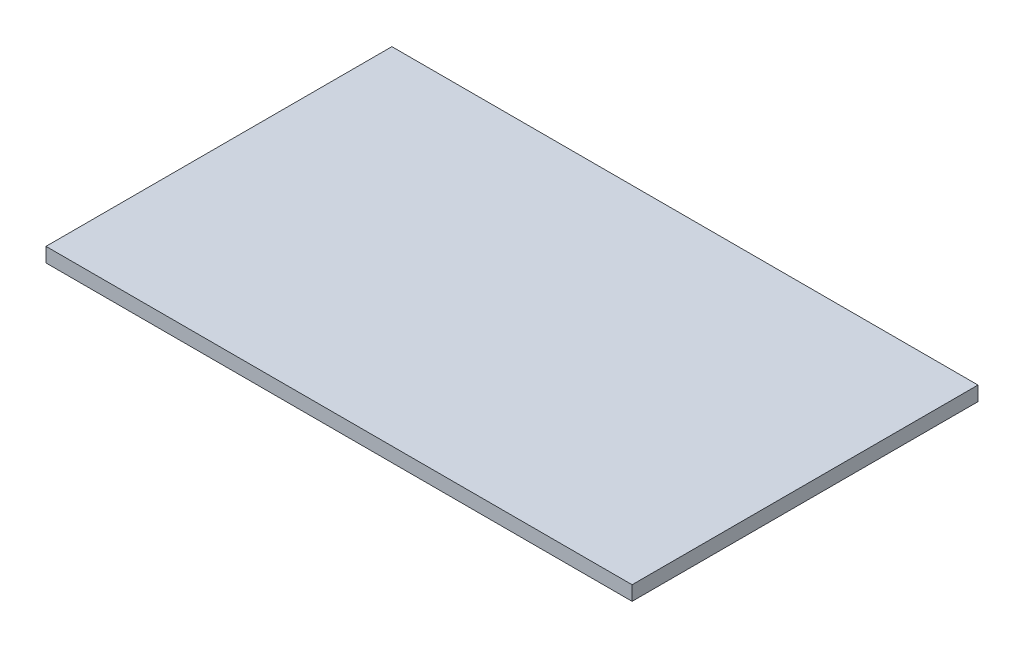
ISO-10303-21;
HEADER;
FILE_DESCRIPTION(('STEP AP214'),'2;1');
FILE_NAME('part.step','',(''),(''),'','','');
FILE_SCHEMA(('AUTOMOTIVE_DESIGN { 1 0 10303 214 1 1 1 1 }'));
ENDSEC;
DATA;
#1=APPLICATION_CONTEXT('core data for automotive mechanical design processes');
#2=APPLICATION_PROTOCOL_DEFINITION('international standard','automotive_design',2000,#1);
#3=PRODUCT_CONTEXT('',#1,'mechanical');
#4=PRODUCT('Part','Part','',(#3));
#5=PRODUCT_RELATED_PRODUCT_CATEGORY('part','',(#4));
#6=PRODUCT_DEFINITION_FORMATION('','',#4);
#7=PRODUCT_DEFINITION_CONTEXT('part definition',#1,'design');
#8=PRODUCT_DEFINITION('design','',#6,#7);
#9=PRODUCT_DEFINITION_SHAPE('','',#8);
#10=(LENGTH_UNIT() NAMED_UNIT(*) SI_UNIT(.MILLI.,.METRE.));
#11=(NAMED_UNIT(*) PLANE_ANGLE_UNIT() SI_UNIT($,.RADIAN.));
#12=(NAMED_UNIT(*) SI_UNIT($,.STERADIAN.) SOLID_ANGLE_UNIT());
#13=UNCERTAINTY_MEASURE_WITH_UNIT(LENGTH_MEASURE(1.E-05),#10,'distance_accuracy_value','');
#14=(GEOMETRIC_REPRESENTATION_CONTEXT(3) GLOBAL_UNCERTAINTY_ASSIGNED_CONTEXT((#13)) GLOBAL_UNIT_ASSIGNED_CONTEXT((#10,
#11,#12)) REPRESENTATION_CONTEXT('',''));
#15=CARTESIAN_POINT('',(0.,0.,0.));
#16=DIRECTION('',(0.,0.,1.));
#17=DIRECTION('',(1.,0.,0.));
#18=AXIS2_PLACEMENT_3D('',#15,#16,#17);
#19=CARTESIAN_POINT('',(-46.2660746500902,15.,-27.642019176537));
#20=DIRECTION('',(1.,0.,0.));
#21=DIRECTION('',(0.,0.,-1.));
#22=AXIS2_PLACEMENT_3D('',#19,#20,#21);
#23=PLANE('',#22);
#24=DIRECTION('',(0.,0.,1.));
#25=VECTOR('',#24,1.);
#26=CARTESIAN_POINT('',(-46.2660746500902,0.,-27.642019176537));
#27=LINE('',#26,#25);
#28=CARTESIAN_POINT('',(-46.2660746500902,0.,-27.642019176537));
#29=VERTEX_POINT('',#28);
#30=CARTESIAN_POINT('',(-46.2660746500902,0.,332.357980823463));
#31=VERTEX_POINT('',#30);
#32=EDGE_CURVE('E96',#29,#31,#27,.T.);
#33=ORIENTED_EDGE('',*,*,#32,.T.);
#34=DIRECTION('',(0.,-1.,0.));
#35=VECTOR('',#34,1.);
#36=CARTESIAN_POINT('',(-46.2660746500902,15.,332.357980823463));
#37=LINE('',#36,#35);
#38=CARTESIAN_POINT('',(-46.2660746500902,15.,332.357980823463));
#39=VERTEX_POINT('',#38);
#40=EDGE_CURVE('E11',#39,#31,#37,.T.);
#41=ORIENTED_EDGE('',*,*,#40,.F.);
#42=DIRECTION('',(0.,0.,1.));
#43=VECTOR('',#42,1.);
#44=CARTESIAN_POINT('',(-46.2660746500902,15.,-27.642019176537));
#45=LINE('',#44,#43);
#46=CARTESIAN_POINT('',(-46.2660746500902,15.,-27.642019176537));
#47=VERTEX_POINT('',#46);
#48=EDGE_CURVE('E84',#47,#39,#45,.T.);
#49=ORIENTED_EDGE('',*,*,#48,.F.);
#50=DIRECTION('',(0.,-1.,0.));
#51=VECTOR('',#50,1.);
#52=CARTESIAN_POINT('',(-46.2660746500902,15.,-27.642019176537));
#53=LINE('',#52,#51);
#54=EDGE_CURVE('E92',#47,#29,#53,.T.);
#55=ORIENTED_EDGE('',*,*,#54,.T.);
#56=EDGE_LOOP('',(#33,#41,#49,#55));
#57=FACE_BOUND('',#56,.T.);
#58=ADVANCED_FACE('F33',(#57),#23,.F.);
#59=CARTESIAN_POINT('',(-46.2660746500902,15.,332.357980823463));
#60=DIRECTION('',(0.,0.,-1.));
#61=DIRECTION('',(-1.,0.,0.));
#62=AXIS2_PLACEMENT_3D('',#59,#60,#61);
#63=PLANE('',#62);
#64=DIRECTION('',(1.,0.,0.));
#65=VECTOR('',#64,1.);
#66=CARTESIAN_POINT('',(-46.2660746500902,0.,332.357980823463));
#67=LINE('',#66,#65);
#68=CARTESIAN_POINT('',(563.73392534991,0.,332.357980823463));
#69=VERTEX_POINT('',#68);
#70=EDGE_CURVE('E88',#31,#69,#67,.T.);
#71=ORIENTED_EDGE('',*,*,#70,.T.);
#72=DIRECTION('',(0.,-1.,0.));
#73=VECTOR('',#72,1.);
#74=CARTESIAN_POINT('',(563.73392534991,15.,332.357980823463));
#75=LINE('',#74,#73);
#76=CARTESIAN_POINT('',(563.73392534991,15.,332.357980823463));
#77=VERTEX_POINT('',#76);
#78=EDGE_CURVE('E41',#77,#69,#75,.T.);
#79=ORIENTED_EDGE('',*,*,#78,.F.);
#80=DIRECTION('',(1.,0.,0.));
#81=VECTOR('',#80,1.);
#82=CARTESIAN_POINT('',(-46.2660746500902,15.,332.357980823463));
#83=LINE('',#82,#81);
#84=EDGE_CURVE('E79',#39,#77,#83,.T.);
#85=ORIENTED_EDGE('',*,*,#84,.F.);
#86=ORIENTED_EDGE('',*,*,#40,.T.);
#87=EDGE_LOOP('',(#71,#79,#85,#86));
#88=FACE_BOUND('',#87,.T.);
#89=ADVANCED_FACE('F87',(#88),#63,.F.);
#90=CARTESIAN_POINT('',(563.73392534991,15.,-27.642019176537));
#91=DIRECTION('',(-1.,0.,0.));
#92=DIRECTION('',(0.,0.,1.));
#93=AXIS2_PLACEMENT_3D('',#90,#91,#92);
#94=PLANE('',#93);
#95=DIRECTION('',(0.,0.,-1.));
#96=VECTOR('',#95,1.);
#97=CARTESIAN_POINT('',(563.73392534991,0.,-27.642019176537));
#98=LINE('',#97,#96);
#99=CARTESIAN_POINT('',(563.73392534991,0.,-27.642019176537));
#100=VERTEX_POINT('',#99);
#101=EDGE_CURVE('E66',#69,#100,#98,.T.);
#102=ORIENTED_EDGE('',*,*,#101,.T.);
#103=DIRECTION('',(0.,-1.,0.));
#104=VECTOR('',#103,1.);
#105=CARTESIAN_POINT('',(563.73392534991,15.,-27.642019176537));
#106=LINE('',#105,#104);
#107=CARTESIAN_POINT('',(563.73392534991,15.,-27.642019176537));
#108=VERTEX_POINT('',#107);
#109=EDGE_CURVE('E89',#108,#100,#106,.T.);
#110=ORIENTED_EDGE('',*,*,#109,.F.);
#111=DIRECTION('',(0.,0.,-1.));
#112=VECTOR('',#111,1.);
#113=CARTESIAN_POINT('',(563.73392534991,15.,-27.642019176537));
#114=LINE('',#113,#112);
#115=EDGE_CURVE('E82',#77,#108,#114,.T.);
#116=ORIENTED_EDGE('',*,*,#115,.F.);
#117=ORIENTED_EDGE('',*,*,#78,.T.);
#118=EDGE_LOOP('',(#102,#110,#116,#117));
#119=FACE_BOUND('',#118,.T.);
#120=ADVANCED_FACE('F90',(#119),#94,.F.);
#121=CARTESIAN_POINT('',(-46.2660746500902,15.,-27.642019176537));
#122=DIRECTION('',(0.,0.,1.));
#123=DIRECTION('',(1.,0.,0.));
#124=AXIS2_PLACEMENT_3D('',#121,#122,#123);
#125=PLANE('',#124);
#126=DIRECTION('',(-1.,0.,0.));
#127=VECTOR('',#126,1.);
#128=CARTESIAN_POINT('',(-46.2660746500902,0.,-27.642019176537));
#129=LINE('',#128,#127);
#130=EDGE_CURVE('E72',#100,#29,#129,.T.);
#131=ORIENTED_EDGE('',*,*,#130,.T.);
#132=ORIENTED_EDGE('',*,*,#54,.F.);
#133=DIRECTION('',(-1.,0.,0.));
#134=VECTOR('',#133,1.);
#135=CARTESIAN_POINT('',(-46.2660746500902,15.,-27.642019176537));
#136=LINE('',#135,#134);
#137=EDGE_CURVE('E49',#108,#47,#136,.T.);
#138=ORIENTED_EDGE('',*,*,#137,.F.);
#139=ORIENTED_EDGE('',*,*,#109,.T.);
#140=EDGE_LOOP('',(#131,#132,#138,#139));
#141=FACE_BOUND('',#140,.T.);
#142=ADVANCED_FACE('F103',(#141),#125,.F.);
#143=CARTESIAN_POINT('',(0.,15.,0.));
#144=DIRECTION('',(0.,1.,0.));
#145=DIRECTION('',(0.,0.,1.));
#146=AXIS2_PLACEMENT_3D('',#143,#144,#145);
#147=PLANE('',#146);
#148=ORIENTED_EDGE('',*,*,#48,.T.);
#149=ORIENTED_EDGE('',*,*,#84,.T.);
#150=ORIENTED_EDGE('',*,*,#115,.T.);
#151=ORIENTED_EDGE('',*,*,#137,.T.);
#152=EDGE_LOOP('',(#148,#149,#150,#151));
#153=FACE_BOUND('',#152,.T.);
#154=ADVANCED_FACE('F80',(#153),#147,.T.);
#155=CARTESIAN_POINT('',(0.,0.,0.));
#156=DIRECTION('',(0.,1.,0.));
#157=DIRECTION('',(0.,0.,1.));
#158=AXIS2_PLACEMENT_3D('',#155,#156,#157);
#159=PLANE('',#158);
#160=ORIENTED_EDGE('',*,*,#32,.F.);
#161=ORIENTED_EDGE('',*,*,#130,.F.);
#162=ORIENTED_EDGE('',*,*,#101,.F.);
#163=ORIENTED_EDGE('',*,*,#70,.F.);
#164=EDGE_LOOP('',(#160,#161,#162,#163));
#165=FACE_BOUND('',#164,.T.);
#166=ADVANCED_FACE('F106',(#165),#159,.F.);
#167=CLOSED_SHELL('',(#58,#89,#120,#142,#154,#166));
#168=MANIFOLD_SOLID_BREP('B2',#167);
#169=ADVANCED_BREP_SHAPE_REPRESENTATION('',(#18,#168),#14);
#170=SHAPE_DEFINITION_REPRESENTATION(#9,#169);
ENDSEC;
END-ISO-10303-21;
